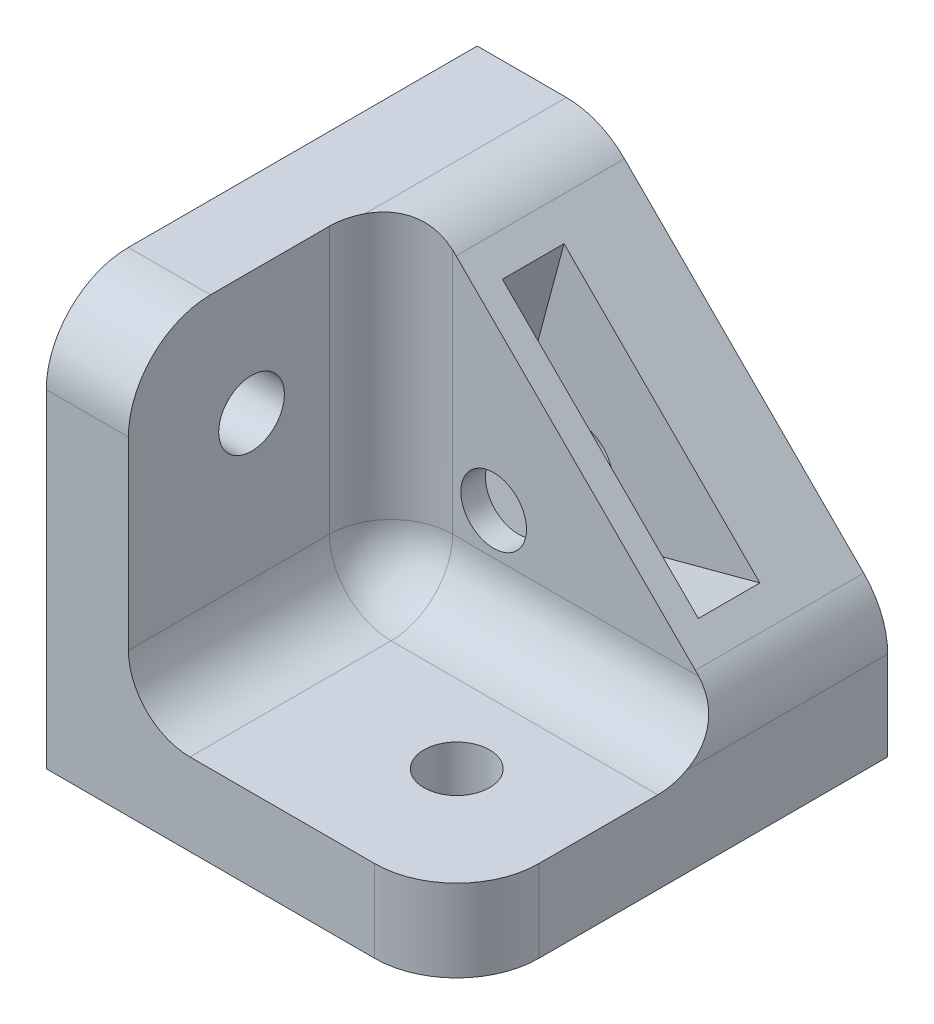
ISO-10303-21;
HEADER;
FILE_DESCRIPTION(('STEP AP214'),'2;1');
FILE_NAME('part.step','',(''),(''),'','','');
FILE_SCHEMA(('AUTOMOTIVE_DESIGN { 1 0 10303 214 1 1 1 1 }'));
ENDSEC;
DATA;
#1=APPLICATION_CONTEXT('core data for automotive mechanical design processes');
#2=APPLICATION_PROTOCOL_DEFINITION('international standard','automotive_design',2000,#1);
#3=PRODUCT_CONTEXT('',#1,'mechanical');
#4=PRODUCT('Part','Part','',(#3));
#5=PRODUCT_RELATED_PRODUCT_CATEGORY('part','',(#4));
#6=PRODUCT_DEFINITION_FORMATION('','',#4);
#7=PRODUCT_DEFINITION_CONTEXT('part definition',#1,'design');
#8=PRODUCT_DEFINITION('design','',#6,#7);
#9=PRODUCT_DEFINITION_SHAPE('','',#8);
#10=(LENGTH_UNIT() NAMED_UNIT(*) SI_UNIT(.MILLI.,.METRE.));
#11=(NAMED_UNIT(*) PLANE_ANGLE_UNIT() SI_UNIT($,.RADIAN.));
#12=(NAMED_UNIT(*) SI_UNIT($,.STERADIAN.) SOLID_ANGLE_UNIT());
#13=UNCERTAINTY_MEASURE_WITH_UNIT(LENGTH_MEASURE(1.E-05),#10,'distance_accuracy_value','');
#14=(GEOMETRIC_REPRESENTATION_CONTEXT(3) GLOBAL_UNCERTAINTY_ASSIGNED_CONTEXT((#13)) GLOBAL_UNIT_ASSIGNED_CONTEXT((#10,
#11,#12)) REPRESENTATION_CONTEXT('',''));
#15=CARTESIAN_POINT('',(0.,0.,0.));
#16=DIRECTION('',(0.,0.,1.));
#17=DIRECTION('',(1.,0.,0.));
#18=AXIS2_PLACEMENT_3D('',#15,#16,#17);
#19=CARTESIAN_POINT('',(9.,9.,0.));
#20=DIRECTION('',(0.,0.,-1.));
#21=DIRECTION('',(-1.,0.,0.));
#22=AXIS2_PLACEMENT_3D('',#19,#20,#21);
#23=CYLINDRICAL_SURFACE('',#22,1.59999999999999);
#24=CARTESIAN_POINT('',(9.,9.,0.));
#25=DIRECTION('',(0.,0.,-1.));
#26=DIRECTION('',(-1.,0.,0.));
#27=AXIS2_PLACEMENT_3D('',#24,#25,#26);
#28=CIRCLE('',#27,1.59999999999999);
#29=CARTESIAN_POINT('',(7.40000000000001,9.,0.));
#30=VERTEX_POINT('',#29);
#31=EDGE_CURVE('E220',#30,#30,#28,.T.);
#32=ORIENTED_EDGE('',*,*,#31,.T.);
#33=EDGE_LOOP('',(#32));
#34=FACE_BOUND('',#33,.T.);
#35=CARTESIAN_POINT('',(9.,9.,4.));
#36=DIRECTION('',(0.,0.,1.));
#37=DIRECTION('',(1.,0.,0.));
#38=AXIS2_PLACEMENT_3D('',#35,#36,#37);
#39=CIRCLE('',#38,1.59999999999999);
#40=CARTESIAN_POINT('',(10.6,9.,4.));
#41=VERTEX_POINT('',#40);
#42=EDGE_CURVE('E430',#41,#41,#39,.F.);
#43=ORIENTED_EDGE('',*,*,#42,.F.);
#44=EDGE_LOOP('',(#43));
#45=FACE_BOUND('',#44,.T.);
#46=ADVANCED_FACE('F48',(#34,#45),#23,.F.);
#47=CARTESIAN_POINT('',(20.,0.,8.2));
#48=DIRECTION('',(-1.,0.,0.));
#49=DIRECTION('',(0.,-1.,0.));
#50=AXIS2_PLACEMENT_3D('',#47,#48,#49);
#51=PLANE('',#50);
#52=DIRECTION('',(0.,1.,0.));
#53=VECTOR('',#52,1.);
#54=CARTESIAN_POINT('',(20.,0.,0.));
#55=LINE('',#54,#53);
#56=CARTESIAN_POINT('',(20.,0.,0.));
#57=VERTEX_POINT('',#56);
#58=CARTESIAN_POINT('',(20.,4.34314575050762,0.));
#59=VERTEX_POINT('',#58);
#60=EDGE_CURVE('E240',#57,#59,#55,.T.);
#61=ORIENTED_EDGE('',*,*,#60,.T.);
#62=DIRECTION('',(0.,0.,-1.));
#63=VECTOR('',#62,1.);
#64=CARTESIAN_POINT('',(20.,4.34314575050762,8.37157287525375));
#65=LINE('',#64,#63);
#66=CARTESIAN_POINT('',(20.,4.34314575050762,9.80675720100397));
#67=VERTEX_POINT('',#66);
#68=EDGE_CURVE('E481',#59,#67,#65,.F.);
#69=ORIENTED_EDGE('',*,*,#68,.T.);
#70=CARTESIAN_POINT('',(20.,7.,11.2));
#71=DIRECTION('',(-1.,0.,0.));
#72=DIRECTION('',(0.,-1.,0.));
#73=AXIS2_PLACEMENT_3D('',#70,#71,#72);
#74=CIRCLE('',#73,3.);
#75=CARTESIAN_POINT('',(20.,4.,11.2));
#76=VERTEX_POINT('',#75);
#77=EDGE_CURVE('E283',#67,#76,#74,.T.);
#78=ORIENTED_EDGE('',*,*,#77,.T.);
#79=DIRECTION('',(0.,0.,-1.));
#80=VECTOR('',#79,1.);
#81=CARTESIAN_POINT('',(20.,4.,21.));
#82=LINE('',#81,#80);
#83=CARTESIAN_POINT('',(20.,4.,17.));
#84=VERTEX_POINT('',#83);
#85=EDGE_CURVE('E238',#84,#76,#82,.T.);
#86=ORIENTED_EDGE('',*,*,#85,.F.);
#87=DIRECTION('',(0.,1.,0.));
#88=VECTOR('',#87,1.);
#89=CARTESIAN_POINT('',(20.,0.,17.));
#90=LINE('',#89,#88);
#91=CARTESIAN_POINT('',(20.,0.,17.));
#92=VERTEX_POINT('',#91);
#93=EDGE_CURVE('E325',#84,#92,#90,.F.);
#94=ORIENTED_EDGE('',*,*,#93,.T.);
#95=DIRECTION('',(0.,0.,-1.));
#96=VECTOR('',#95,1.);
#97=CARTESIAN_POINT('',(20.,0.,8.2));
#98=LINE('',#97,#96);
#99=EDGE_CURVE('E244',#92,#57,#98,.T.);
#100=ORIENTED_EDGE('',*,*,#99,.T.);
#101=EDGE_LOOP('',(#61,#69,#78,#86,#94,#100));
#102=FACE_BOUND('',#101,.T.);
#103=ADVANCED_FACE('F350',(#102),#51,.F.);
#104=CARTESIAN_POINT('',(13.,13.,8.2));
#105=DIRECTION('',(0.707106781186547,0.707106781186548,0.));
#106=DIRECTION('',(-0.707106781186548,0.707106781186547,0.));
#107=AXIS2_PLACEMENT_3D('',#104,#105,#106);
#108=PLANE('',#107);
#109=DIRECTION('',(0.707106781186548,-0.707106781186547,0.));
#110=VECTOR('',#109,1.);
#111=CARTESIAN_POINT('',(8.22841718477347,17.7715828152265,7.));
#112=LINE('',#111,#110);
#113=CARTESIAN_POINT('',(8.22841718477347,17.7715828152265,7.));
#114=VERTEX_POINT('',#113);
#115=CARTESIAN_POINT('',(17.7715828152265,8.22841718477347,7.));
#116=VERTEX_POINT('',#115);
#117=EDGE_CURVE('E190',#114,#116,#112,.T.);
#118=ORIENTED_EDGE('',*,*,#117,.F.);
#119=DIRECTION('',(0.,0.,-1.));
#120=VECTOR('',#119,1.);
#121=CARTESIAN_POINT('',(8.22841718477347,17.7715828152265,7.));
#122=LINE('',#121,#120);
#123=CARTESIAN_POINT('',(8.22841718477347,17.7715828152265,4.));
#124=VERTEX_POINT('',#123);
#125=EDGE_CURVE('E432',#114,#124,#122,.T.);
#126=ORIENTED_EDGE('',*,*,#125,.T.);
#127=DIRECTION('',(0.707106781186548,-0.707106781186547,0.));
#128=VECTOR('',#127,1.);
#129=CARTESIAN_POINT('',(8.22841718477347,17.7715828152265,4.));
#130=LINE('',#129,#128);
#131=CARTESIAN_POINT('',(17.7715828152265,8.22841718477348,4.));
#132=VERTEX_POINT('',#131);
#133=EDGE_CURVE('E204',#124,#132,#130,.T.);
#134=ORIENTED_EDGE('',*,*,#133,.T.);
#135=DIRECTION('',(0.,0.,-1.));
#136=VECTOR('',#135,1.);
#137=CARTESIAN_POINT('',(17.7715828152265,8.22841718477347,7.));
#138=LINE('',#137,#136);
#139=EDGE_CURVE('E183',#116,#132,#138,.T.);
#140=ORIENTED_EDGE('',*,*,#139,.F.);
#141=EDGE_LOOP('',(#118,#126,#134,#140));
#142=FACE_BOUND('',#141,.T.);
#143=DIRECTION('',(0.707106781186548,-0.707106781186547,0.));
#144=VECTOR('',#143,1.);
#145=CARTESIAN_POINT('',(13.,13.,0.));
#146=LINE('',#145,#144);
#147=CARTESIAN_POINT('',(7.17157287525381,18.8284271247462,0.));
#148=VERTEX_POINT('',#147);
#149=CARTESIAN_POINT('',(18.8284271247462,7.17157287525381,0.));
#150=VERTEX_POINT('',#149);
#151=EDGE_CURVE('E248',#148,#150,#146,.T.);
#152=ORIENTED_EDGE('',*,*,#151,.F.);
#153=DIRECTION('',(0.,0.,-1.));
#154=VECTOR('',#153,1.);
#155=CARTESIAN_POINT('',(7.17157287525381,18.8284271247462,8.2));
#156=LINE('',#155,#154);
#157=CARTESIAN_POINT('',(7.17157287525381,18.8284271247462,8.2));
#158=VERTEX_POINT('',#157);
#159=EDGE_CURVE('E311',#148,#158,#156,.F.);
#160=ORIENTED_EDGE('',*,*,#159,.T.);
#161=DIRECTION('',(0.707106781186548,-0.707106781186547,0.));
#162=VECTOR('',#161,1.);
#163=CARTESIAN_POINT('',(13.,13.,8.2));
#164=LINE('',#163,#162);
#165=CARTESIAN_POINT('',(18.8284271247462,7.17157287525381,8.2));
#166=VERTEX_POINT('',#165);
#167=EDGE_CURVE('E241',#158,#166,#164,.T.);
#168=ORIENTED_EDGE('',*,*,#167,.T.);
#169=DIRECTION('',(0.,0.,-1.));
#170=VECTOR('',#169,1.);
#171=CARTESIAN_POINT('',(18.8284271247462,7.17157287525382,0.));
#172=LINE('',#171,#170);
#173=EDGE_CURVE('E308',#166,#150,#172,.T.);
#174=ORIENTED_EDGE('',*,*,#173,.T.);
#175=EDGE_LOOP('',(#152,#160,#168,#174));
#176=FACE_BOUND('',#175,.T.);
#177=ADVANCED_FACE('F202',(#142,#176),#108,.T.);
#178=CARTESIAN_POINT('',(0.,20.,8.2));
#179=DIRECTION('',(0.,1.,0.));
#180=DIRECTION('',(0.,0.,1.));
#181=AXIS2_PLACEMENT_3D('',#178,#179,#180);
#182=PLANE('',#181);
#183=CARTESIAN_POINT('',(7.,20.,11.2));
#184=DIRECTION('',(0.,1.,0.));
#185=DIRECTION('',(0.,0.,1.));
#186=AXIS2_PLACEMENT_3D('',#183,#184,#185);
#187=CIRCLE('',#186,3.);
#188=CARTESIAN_POINT('',(4.,20.,11.2));
#189=VERTEX_POINT('',#188);
#190=CARTESIAN_POINT('',(4.34314575050762,20.,9.80675720100396));
#191=VERTEX_POINT('',#190);
#192=EDGE_CURVE('E288',#189,#191,#187,.F.);
#193=ORIENTED_EDGE('',*,*,#192,.T.);
#194=DIRECTION('',(0.,0.,-1.));
#195=VECTOR('',#194,1.);
#196=CARTESIAN_POINT('',(4.34314575050762,20.,8.2));
#197=LINE('',#196,#195);
#198=CARTESIAN_POINT('',(4.34314575050762,20.,0.));
#199=VERTEX_POINT('',#198);
#200=EDGE_CURVE('E301',#191,#199,#197,.T.);
#201=ORIENTED_EDGE('',*,*,#200,.T.);
#202=DIRECTION('',(1.,0.,0.));
#203=VECTOR('',#202,1.);
#204=CARTESIAN_POINT('',(0.,20.,0.));
#205=LINE('',#204,#203);
#206=CARTESIAN_POINT('',(0.,20.,0.));
#207=VERTEX_POINT('',#206);
#208=EDGE_CURVE('E251',#207,#199,#205,.T.);
#209=ORIENTED_EDGE('',*,*,#208,.F.);
#210=DIRECTION('',(0.,0.,-1.));
#211=VECTOR('',#210,1.);
#212=CARTESIAN_POINT('',(0.,20.,8.2));
#213=LINE('',#212,#211);
#214=CARTESIAN_POINT('',(0.,20.,17.));
#215=VERTEX_POINT('',#214);
#216=EDGE_CURVE('E262',#215,#207,#213,.T.);
#217=ORIENTED_EDGE('',*,*,#216,.F.);
#218=DIRECTION('',(1.,0.,0.));
#219=VECTOR('',#218,1.);
#220=CARTESIAN_POINT('',(0.,20.,17.));
#221=LINE('',#220,#219);
#222=CARTESIAN_POINT('',(4.,20.,17.));
#223=VERTEX_POINT('',#222);
#224=EDGE_CURVE('E291',#215,#223,#221,.T.);
#225=ORIENTED_EDGE('',*,*,#224,.T.);
#226=DIRECTION('',(0.,0.,-1.));
#227=VECTOR('',#226,1.);
#228=CARTESIAN_POINT('',(4.,20.,21.));
#229=LINE('',#228,#227);
#230=EDGE_CURVE('E236',#223,#189,#229,.T.);
#231=ORIENTED_EDGE('',*,*,#230,.T.);
#232=EDGE_LOOP('',(#193,#201,#209,#217,#225,#231));
#233=FACE_BOUND('',#232,.T.);
#234=ADVANCED_FACE('F395',(#233),#182,.T.);
#235=CARTESIAN_POINT('',(0.,0.,8.2));
#236=DIRECTION('',(-1.,0.,0.));
#237=DIRECTION('',(0.,0.,1.));
#238=AXIS2_PLACEMENT_3D('',#235,#236,#237);
#239=PLANE('',#238);
#240=CARTESIAN_POINT('',(0.,14.,15.));
#241=DIRECTION('',(-1.,0.,0.));
#242=DIRECTION('',(0.,0.,1.));
#243=AXIS2_PLACEMENT_3D('',#240,#241,#242);
#244=CIRCLE('',#243,1.59999999999999);
#245=CARTESIAN_POINT('',(0.,14.,16.6));
#246=VERTEX_POINT('',#245);
#247=EDGE_CURVE('E216',#246,#246,#244,.T.);
#248=ORIENTED_EDGE('',*,*,#247,.F.);
#249=EDGE_LOOP('',(#248));
#250=FACE_BOUND('',#249,.T.);
#251=DIRECTION('',(0.,1.,0.));
#252=VECTOR('',#251,1.);
#253=CARTESIAN_POINT('',(0.,0.,21.));
#254=LINE('',#253,#252);
#255=CARTESIAN_POINT('',(0.,0.,21.));
#256=VERTEX_POINT('',#255);
#257=CARTESIAN_POINT('',(0.,16.,21.));
#258=VERTEX_POINT('',#257);
#259=EDGE_CURVE('E234',#256,#258,#254,.T.);
#260=ORIENTED_EDGE('',*,*,#259,.T.);
#261=CARTESIAN_POINT('',(0.,16.,17.));
#262=DIRECTION('',(-1.,0.,0.));
#263=DIRECTION('',(0.,0.,1.));
#264=AXIS2_PLACEMENT_3D('',#261,#262,#263);
#265=CIRCLE('',#264,4.);
#266=EDGE_CURVE('E13',#258,#215,#265,.T.);
#267=ORIENTED_EDGE('',*,*,#266,.T.);
#268=ORIENTED_EDGE('',*,*,#216,.T.);
#269=DIRECTION('',(0.,1.,0.));
#270=VECTOR('',#269,1.);
#271=CARTESIAN_POINT('',(0.,0.,0.));
#272=LINE('',#271,#270);
#273=CARTESIAN_POINT('',(0.,0.,0.));
#274=VERTEX_POINT('',#273);
#275=EDGE_CURVE('E254',#274,#207,#272,.T.);
#276=ORIENTED_EDGE('',*,*,#275,.F.);
#277=DIRECTION('',(0.,0.,-1.));
#278=VECTOR('',#277,1.);
#279=CARTESIAN_POINT('',(0.,0.,8.2));
#280=LINE('',#279,#278);
#281=EDGE_CURVE('E260',#256,#274,#280,.T.);
#282=ORIENTED_EDGE('',*,*,#281,.F.);
#283=EDGE_LOOP('',(#260,#267,#268,#276,#282));
#284=FACE_BOUND('',#283,.T.);
#285=ADVANCED_FACE('F490',(#250,#284),#239,.T.);
#286=CARTESIAN_POINT('',(0.,0.,8.2));
#287=DIRECTION('',(0.,1.,0.));
#288=DIRECTION('',(0.,0.,1.));
#289=AXIS2_PLACEMENT_3D('',#286,#287,#288);
#290=PLANE('',#289);
#291=CARTESIAN_POINT('',(14.,0.,15.));
#292=DIRECTION('',(0.,-1.,0.));
#293=DIRECTION('',(0.,0.,-1.));
#294=AXIS2_PLACEMENT_3D('',#291,#292,#293);
#295=CIRCLE('',#294,1.59999999999999);
#296=CARTESIAN_POINT('',(14.,0.,13.4));
#297=VERTEX_POINT('',#296);
#298=EDGE_CURVE('E211',#297,#297,#295,.T.);
#299=ORIENTED_EDGE('',*,*,#298,.F.);
#300=EDGE_LOOP('',(#299));
#301=FACE_BOUND('',#300,.T.);
#302=ORIENTED_EDGE('',*,*,#99,.F.);
#303=CARTESIAN_POINT('',(16.,0.,17.));
#304=DIRECTION('',(0.,1.,0.));
#305=DIRECTION('',(0.,0.,1.));
#306=AXIS2_PLACEMENT_3D('',#303,#304,#305);
#307=CIRCLE('',#306,4.);
#308=CARTESIAN_POINT('',(16.,0.,21.));
#309=VERTEX_POINT('',#308);
#310=EDGE_CURVE('E425',#92,#309,#307,.F.);
#311=ORIENTED_EDGE('',*,*,#310,.T.);
#312=DIRECTION('',(1.,0.,0.));
#313=VECTOR('',#312,1.);
#314=CARTESIAN_POINT('',(0.,0.,21.));
#315=LINE('',#314,#313);
#316=EDGE_CURVE('E226',#256,#309,#315,.T.);
#317=ORIENTED_EDGE('',*,*,#316,.F.);
#318=ORIENTED_EDGE('',*,*,#281,.T.);
#319=DIRECTION('',(1.,0.,0.));
#320=VECTOR('',#319,1.);
#321=CARTESIAN_POINT('',(0.,0.,0.));
#322=LINE('',#321,#320);
#323=EDGE_CURVE('E245',#274,#57,#322,.T.);
#324=ORIENTED_EDGE('',*,*,#323,.T.);
#325=EDGE_LOOP('',(#302,#311,#317,#318,#324));
#326=FACE_BOUND('',#325,.T.);
#327=ADVANCED_FACE('F380',(#301,#326),#290,.F.);
#328=CARTESIAN_POINT('',(0.,0.,8.2));
#329=DIRECTION('',(0.,0.,1.));
#330=DIRECTION('',(1.,0.,0.));
#331=AXIS2_PLACEMENT_3D('',#328,#329,#330);
#332=PLANE('',#331);
#333=CARTESIAN_POINT('',(9.,9.,8.2));
#334=DIRECTION('',(0.,0.,1.));
#335=DIRECTION('',(1.,0.,0.));
#336=AXIS2_PLACEMENT_3D('',#333,#334,#335);
#337=CIRCLE('',#336,1.59999999999999);
#338=CARTESIAN_POINT('',(10.6,9.,8.2));
#339=VERTEX_POINT('',#338);
#340=EDGE_CURVE('E223',#339,#339,#337,.T.);
#341=ORIENTED_EDGE('',*,*,#340,.F.);
#342=EDGE_LOOP('',(#341));
#343=FACE_BOUND('',#342,.T.);
#344=ORIENTED_EDGE('',*,*,#167,.F.);
#345=CARTESIAN_POINT('',(4.34314575050762,16.,8.2));
#346=DIRECTION('',(0.,0.,1.));
#347=DIRECTION('',(1.,0.,0.));
#348=AXIS2_PLACEMENT_3D('',#345,#346,#347);
#349=CIRCLE('',#348,4.);
#350=CARTESIAN_POINT('',(7.,18.9901714828675,8.2));
#351=VERTEX_POINT('',#350);
#352=EDGE_CURVE('E315',#158,#351,#349,.T.);
#353=ORIENTED_EDGE('',*,*,#352,.T.);
#354=DIRECTION('',(0.,-1.,0.));
#355=VECTOR('',#354,1.);
#356=CARTESIAN_POINT('',(7.,0.,8.2));
#357=LINE('',#356,#355);
#358=CARTESIAN_POINT('',(7.,7.,8.2));
#359=VERTEX_POINT('',#358);
#360=EDGE_CURVE('E273',#351,#359,#357,.T.);
#361=ORIENTED_EDGE('',*,*,#360,.T.);
#362=DIRECTION('',(-1.,0.,0.));
#363=VECTOR('',#362,1.);
#364=CARTESIAN_POINT('',(20.,7.,8.2));
#365=LINE('',#364,#363);
#366=CARTESIAN_POINT('',(18.9901714828676,7.,8.2));
#367=VERTEX_POINT('',#366);
#368=EDGE_CURVE('E275',#359,#367,#365,.F.);
#369=ORIENTED_EDGE('',*,*,#368,.T.);
#370=CARTESIAN_POINT('',(16.,4.34314575050762,8.2));
#371=DIRECTION('',(0.,0.,1.));
#372=DIRECTION('',(1.,0.,0.));
#373=AXIS2_PLACEMENT_3D('',#370,#371,#372);
#374=CIRCLE('',#373,4.);
#375=EDGE_CURVE('E313',#367,#166,#374,.T.);
#376=ORIENTED_EDGE('',*,*,#375,.T.);
#377=EDGE_LOOP('',(#344,#353,#361,#369,#376));
#378=FACE_BOUND('',#377,.T.);
#379=ADVANCED_FACE('F376',(#343,#378),#332,.T.);
#380=CARTESIAN_POINT('',(0.,0.,0.));
#381=DIRECTION('',(0.,0.,1.));
#382=DIRECTION('',(1.,0.,0.));
#383=AXIS2_PLACEMENT_3D('',#380,#381,#382);
#384=PLANE('',#383);
#385=ORIENTED_EDGE('',*,*,#31,.F.);
#386=EDGE_LOOP('',(#385));
#387=FACE_BOUND('',#386,.T.);
#388=ORIENTED_EDGE('',*,*,#208,.T.);
#389=CARTESIAN_POINT('',(4.34314575050762,16.,0.));
#390=DIRECTION('',(0.,0.,1.));
#391=DIRECTION('',(1.,0.,0.));
#392=AXIS2_PLACEMENT_3D('',#389,#390,#391);
#393=CIRCLE('',#392,4.);
#394=EDGE_CURVE('E306',#199,#148,#393,.F.);
#395=ORIENTED_EDGE('',*,*,#394,.T.);
#396=ORIENTED_EDGE('',*,*,#151,.T.);
#397=CARTESIAN_POINT('',(16.,4.34314575050762,0.));
#398=DIRECTION('',(0.,0.,1.));
#399=DIRECTION('',(1.,0.,0.));
#400=AXIS2_PLACEMENT_3D('',#397,#398,#399);
#401=CIRCLE('',#400,4.);
#402=EDGE_CURVE('E304',#150,#59,#401,.F.);
#403=ORIENTED_EDGE('',*,*,#402,.T.);
#404=ORIENTED_EDGE('',*,*,#60,.F.);
#405=ORIENTED_EDGE('',*,*,#323,.F.);
#406=ORIENTED_EDGE('',*,*,#275,.T.);
#407=EDGE_LOOP('',(#388,#395,#396,#403,#404,#405,#406));
#408=FACE_BOUND('',#407,.T.);
#409=ADVANCED_FACE('F379',(#387,#408),#384,.F.);
#410=CARTESIAN_POINT('',(0.,4.,21.));
#411=DIRECTION('',(0.,1.,0.));
#412=DIRECTION('',(0.,0.,1.));
#413=AXIS2_PLACEMENT_3D('',#410,#411,#412);
#414=PLANE('',#413);
#415=CARTESIAN_POINT('',(14.,4.,15.));
#416=DIRECTION('',(0.,1.,0.));
#417=DIRECTION('',(0.,0.,1.));
#418=AXIS2_PLACEMENT_3D('',#415,#416,#417);
#419=CIRCLE('',#418,1.59999999999999);
#420=CARTESIAN_POINT('',(14.,4.,16.6));
#421=VERTEX_POINT('',#420);
#422=EDGE_CURVE('E214',#421,#421,#419,.T.);
#423=ORIENTED_EDGE('',*,*,#422,.F.);
#424=EDGE_LOOP('',(#423));
#425=FACE_BOUND('',#424,.T.);
#426=DIRECTION('',(1.,0.,0.));
#427=VECTOR('',#426,1.);
#428=CARTESIAN_POINT('',(0.,4.,21.));
#429=LINE('',#428,#427);
#430=CARTESIAN_POINT('',(7.,4.,21.));
#431=VERTEX_POINT('',#430);
#432=CARTESIAN_POINT('',(16.,4.,21.));
#433=VERTEX_POINT('',#432);
#434=EDGE_CURVE('E229',#431,#433,#429,.T.);
#435=ORIENTED_EDGE('',*,*,#434,.T.);
#436=CARTESIAN_POINT('',(16.,4.,17.));
#437=DIRECTION('',(0.,1.,0.));
#438=DIRECTION('',(0.,0.,1.));
#439=AXIS2_PLACEMENT_3D('',#436,#437,#438);
#440=CIRCLE('',#439,4.);
#441=EDGE_CURVE('E427',#433,#84,#440,.T.);
#442=ORIENTED_EDGE('',*,*,#441,.T.);
#443=ORIENTED_EDGE('',*,*,#85,.T.);
#444=DIRECTION('',(-1.,0.,0.));
#445=VECTOR('',#444,1.);
#446=CARTESIAN_POINT('',(4.,4.,11.2));
#447=LINE('',#446,#445);
#448=CARTESIAN_POINT('',(7.,4.,11.2));
#449=VERTEX_POINT('',#448);
#450=EDGE_CURVE('E270',#76,#449,#447,.T.);
#451=ORIENTED_EDGE('',*,*,#450,.T.);
#452=DIRECTION('',(0.,0.,-1.));
#453=VECTOR('',#452,1.);
#454=CARTESIAN_POINT('',(7.,4.,21.));
#455=LINE('',#454,#453);
#456=EDGE_CURVE('E264',#449,#431,#455,.F.);
#457=ORIENTED_EDGE('',*,*,#456,.T.);
#458=EDGE_LOOP('',(#435,#442,#443,#451,#457));
#459=FACE_BOUND('',#458,.T.);
#460=ADVANCED_FACE('F498',(#425,#459),#414,.T.);
#461=CARTESIAN_POINT('',(4.,0.,21.));
#462=DIRECTION('',(-1.,0.,0.));
#463=DIRECTION('',(0.,0.,1.));
#464=AXIS2_PLACEMENT_3D('',#461,#462,#463);
#465=PLANE('',#464);
#466=CARTESIAN_POINT('',(4.,14.,15.));
#467=DIRECTION('',(-1.,0.,0.));
#468=DIRECTION('',(0.,0.,1.));
#469=AXIS2_PLACEMENT_3D('',#466,#467,#468);
#470=CIRCLE('',#469,1.59999999999999);
#471=CARTESIAN_POINT('',(4.,14.,16.6));
#472=VERTEX_POINT('',#471);
#473=EDGE_CURVE('E219',#472,#472,#470,.T.);
#474=ORIENTED_EDGE('',*,*,#473,.T.);
#475=EDGE_LOOP('',(#474));
#476=FACE_BOUND('',#475,.T.);
#477=ORIENTED_EDGE('',*,*,#230,.F.);
#478=CARTESIAN_POINT('',(4.,16.,17.));
#479=DIRECTION('',(-1.,0.,0.));
#480=DIRECTION('',(0.,0.,1.));
#481=AXIS2_PLACEMENT_3D('',#478,#479,#480);
#482=CIRCLE('',#481,4.);
#483=CARTESIAN_POINT('',(4.,16.,21.));
#484=VERTEX_POINT('',#483);
#485=EDGE_CURVE('E57',#223,#484,#482,.F.);
#486=ORIENTED_EDGE('',*,*,#485,.T.);
#487=DIRECTION('',(0.,1.,0.));
#488=VECTOR('',#487,1.);
#489=CARTESIAN_POINT('',(4.,0.,21.));
#490=LINE('',#489,#488);
#491=CARTESIAN_POINT('',(4.,7.,21.));
#492=VERTEX_POINT('',#491);
#493=EDGE_CURVE('E232',#492,#484,#490,.T.);
#494=ORIENTED_EDGE('',*,*,#493,.F.);
#495=DIRECTION('',(0.,0.,-1.));
#496=VECTOR('',#495,1.);
#497=CARTESIAN_POINT('',(4.,7.,21.));
#498=LINE('',#497,#496);
#499=CARTESIAN_POINT('',(4.,7.,11.2));
#500=VERTEX_POINT('',#499);
#501=EDGE_CURVE('E281',#492,#500,#498,.T.);
#502=ORIENTED_EDGE('',*,*,#501,.T.);
#503=DIRECTION('',(0.,-1.,0.));
#504=VECTOR('',#503,1.);
#505=CARTESIAN_POINT('',(4.,0.,11.2));
#506=LINE('',#505,#504);
#507=EDGE_CURVE('E278',#500,#189,#506,.F.);
#508=ORIENTED_EDGE('',*,*,#507,.T.);
#509=EDGE_LOOP('',(#477,#486,#494,#502,#508));
#510=FACE_BOUND('',#509,.T.);
#511=ADVANCED_FACE('F370',(#476,#510),#465,.F.);
#512=CARTESIAN_POINT('',(0.,0.,21.));
#513=DIRECTION('',(0.,0.,1.));
#514=DIRECTION('',(1.,0.,0.));
#515=AXIS2_PLACEMENT_3D('',#512,#513,#514);
#516=PLANE('',#515);
#517=ORIENTED_EDGE('',*,*,#316,.T.);
#518=DIRECTION('',(0.,1.,0.));
#519=VECTOR('',#518,1.);
#520=CARTESIAN_POINT('',(16.,4.,21.));
#521=LINE('',#520,#519);
#522=EDGE_CURVE('E688',#309,#433,#521,.T.);
#523=ORIENTED_EDGE('',*,*,#522,.T.);
#524=ORIENTED_EDGE('',*,*,#434,.F.);
#525=CARTESIAN_POINT('',(7.,7.,21.));
#526=DIRECTION('',(0.,0.,1.));
#527=DIRECTION('',(1.,0.,0.));
#528=AXIS2_PLACEMENT_3D('',#525,#526,#527);
#529=CIRCLE('',#528,3.);
#530=EDGE_CURVE('E286',#431,#492,#529,.F.);
#531=ORIENTED_EDGE('',*,*,#530,.T.);
#532=ORIENTED_EDGE('',*,*,#493,.T.);
#533=DIRECTION('',(1.,0.,0.));
#534=VECTOR('',#533,1.);
#535=CARTESIAN_POINT('',(0.,16.,21.));
#536=LINE('',#535,#534);
#537=EDGE_CURVE('E73',#484,#258,#536,.F.);
#538=ORIENTED_EDGE('',*,*,#537,.T.);
#539=ORIENTED_EDGE('',*,*,#259,.F.);
#540=EDGE_LOOP('',(#517,#523,#524,#531,#532,#538,#539));
#541=FACE_BOUND('',#540,.T.);
#542=ADVANCED_FACE('F363',(#541),#516,.T.);
#543=CARTESIAN_POINT('',(9.,9.,7.));
#544=DIRECTION('',(0.,0.,1.));
#545=DIRECTION('',(1.,0.,0.));
#546=AXIS2_PLACEMENT_3D('',#543,#544,#545);
#547=CIRCLE('',#546,1.59999999999999);
#548=CARTESIAN_POINT('',(10.6,9.,7.));
#549=VERTEX_POINT('',#548);
#550=EDGE_CURVE('E52',#549,#549,#547,.F.);
#551=ORIENTED_EDGE('',*,*,#550,.T.);
#552=EDGE_LOOP('',(#551));
#553=FACE_BOUND('',#552,.T.);
#554=ORIENTED_EDGE('',*,*,#340,.T.);
#555=EDGE_LOOP('',(#554));
#556=FACE_BOUND('',#555,.T.);
#557=ADVANCED_FACE('F353',(#553,#556),#23,.F.);
#558=CARTESIAN_POINT('',(0.,14.,15.));
#559=DIRECTION('',(-1.,0.,0.));
#560=DIRECTION('',(0.,0.,1.));
#561=AXIS2_PLACEMENT_3D('',#558,#559,#560);
#562=CYLINDRICAL_SURFACE('',#561,1.59999999999999);
#563=ORIENTED_EDGE('',*,*,#247,.T.);
#564=EDGE_LOOP('',(#563));
#565=FACE_BOUND('',#564,.T.);
#566=ORIENTED_EDGE('',*,*,#473,.F.);
#567=EDGE_LOOP('',(#566));
#568=FACE_BOUND('',#567,.T.);
#569=ADVANCED_FACE('F345',(#565,#568),#562,.F.);
#570=CARTESIAN_POINT('',(14.,0.,15.));
#571=DIRECTION('',(0.,-1.,0.));
#572=DIRECTION('',(0.,0.,-1.));
#573=AXIS2_PLACEMENT_3D('',#570,#571,#572);
#574=CYLINDRICAL_SURFACE('',#573,1.59999999999999);
#575=ORIENTED_EDGE('',*,*,#422,.T.);
#576=EDGE_LOOP('',(#575));
#577=FACE_BOUND('',#576,.T.);
#578=ORIENTED_EDGE('',*,*,#298,.T.);
#579=EDGE_LOOP('',(#578));
#580=FACE_BOUND('',#579,.T.);
#581=ADVANCED_FACE('F340',(#577,#580),#574,.F.);
#582=CARTESIAN_POINT('',(7.,7.,21.));
#583=DIRECTION('',(0.,0.,-1.));
#584=DIRECTION('',(-1.,0.,0.));
#585=AXIS2_PLACEMENT_3D('',#582,#583,#584);
#586=CYLINDRICAL_SURFACE('',#585,3.);
#587=ORIENTED_EDGE('',*,*,#530,.F.);
#588=ORIENTED_EDGE('',*,*,#456,.F.);
#589=CARTESIAN_POINT('',(7.,7.,11.2));
#590=DIRECTION('',(0.,0.,1.));
#591=DIRECTION('',(1.,0.,0.));
#592=AXIS2_PLACEMENT_3D('',#589,#590,#591);
#593=CIRCLE('',#592,3.);
#594=EDGE_CURVE('E215',#500,#449,#593,.T.);
#595=ORIENTED_EDGE('',*,*,#594,.F.);
#596=ORIENTED_EDGE('',*,*,#501,.F.);
#597=EDGE_LOOP('',(#587,#588,#595,#596));
#598=FACE_BOUND('',#597,.T.);
#599=ADVANCED_FACE('F336',(#598),#586,.F.);
#600=CARTESIAN_POINT('',(7.,0.,11.2));
#601=DIRECTION('',(0.,-1.,0.));
#602=DIRECTION('',(0.,0.,-1.));
#603=AXIS2_PLACEMENT_3D('',#600,#601,#602);
#604=CYLINDRICAL_SURFACE('',#603,3.);
#605=ORIENTED_EDGE('',*,*,#360,.F.);
#606=CARTESIAN_POINT('',(7.,18.9901714828675,8.2));
#607=CARTESIAN_POINT('',(6.94193324538843,19.0417822124814,8.1999949168267));
#608=CARTESIAN_POINT('',(6.8823280799505,19.0916992893009,8.20168608511162));
#609=CARTESIAN_POINT('',(6.76041938623259,19.1879140926809,8.20895913845615));
#610=CARTESIAN_POINT('',(6.69811375017107,19.2342089099468,8.21454411594756));
#611=CARTESIAN_POINT('',(6.57109258991714,19.3229926012827,8.23012712211471));
#612=CARTESIAN_POINT('',(6.50637060865955,19.3654700639315,8.24013788537597));
#613=CARTESIAN_POINT('',(6.37527099763818,19.4462138318352,8.26501058923978));
#614=CARTESIAN_POINT('',(6.30889382863381,19.4844812933363,8.27987119339917));
#615=CARTESIAN_POINT('',(6.17475567829458,19.5568305408274,8.31490001589676));
#616=CARTESIAN_POINT('',(6.10698907042575,19.5908879819129,8.33509716198485));
#617=CARTESIAN_POINT('',(5.97119641030128,19.6544591616513,8.38101077760638));
#618=CARTESIAN_POINT('',(5.90317037354584,19.6839731675356,8.40672692231551));
#619=CARTESIAN_POINT('',(5.76784313091683,19.7383872799478,8.46373223181656));
#620=CARTESIAN_POINT('',(5.70054048218207,19.7632994032598,8.49500645108352));
#621=CARTESIAN_POINT('',(5.56732056667246,19.8087213751306,8.56313837026891));
#622=CARTESIAN_POINT('',(5.50140318204756,19.8292315995557,8.59999559301093));
#623=CARTESIAN_POINT('',(5.31703437153165,19.8816135376273,8.71259891085768));
#624=CARTESIAN_POINT('',(5.20109993187058,19.908503639816,8.79495201602613));
#625=CARTESIAN_POINT('',(4.98078233234528,19.9504535798456,8.97665979283801));
#626=CARTESIAN_POINT('',(4.87642334238074,19.9654890500956,9.07604897515313));
#627=CARTESIAN_POINT('',(4.6939733325975,19.9855162367049,9.27686629517975));
#628=CARTESIAN_POINT('',(4.61423879543945,19.9914729389041,9.37671198661477));
#629=CARTESIAN_POINT('',(4.50477585744998,19.9968995164344,9.53329504232));
#630=CARTESIAN_POINT('',(4.47002527265375,19.9981244537405,9.58653510080915));
#631=CARTESIAN_POINT('',(4.40397082695786,19.9996731797925,9.6951185403529));
#632=CARTESIAN_POINT('',(4.37266664216903,19.999997053289,9.75046172309931));
#633=CARTESIAN_POINT('',(4.34314575050762,20.,9.80675720100396));
#634=B_SPLINE_CURVE_WITH_KNOTS('',3,(#606,#607,#608,#609,#610,#611,#612,#613,#614,#615,#616,
#617,#618,#619,#620,#621,#622,#623,#624,#625,#626,#627,#628,#629,#630,#631,#632,#633),
.UNSPECIFIED.,.F.,.F.,(4,2,2,2,2,2,2,2,2,2,2,2,2,4),(0.,0.233049307220485,0.466283911468105,
0.700194028587575,0.934039742770372,1.169180037518,1.40430649672177,1.63881001782728,
1.87329350733521,2.30528263690606,2.73815743620396,3.12067154591015,3.3113232079451,
3.50195693740874),.UNSPECIFIED.);
#635=EDGE_CURVE('E317',#351,#191,#634,.T.);
#636=ORIENTED_EDGE('',*,*,#635,.T.);
#637=ORIENTED_EDGE('',*,*,#192,.F.);
#638=ORIENTED_EDGE('',*,*,#507,.F.);
#639=CARTESIAN_POINT('',(7.,7.,11.2));
#640=DIRECTION('',(0.,1.,0.));
#641=DIRECTION('',(0.,0.,1.));
#642=AXIS2_PLACEMENT_3D('',#639,#640,#641);
#643=CIRCLE('',#642,3.);
#644=EDGE_CURVE('E294',#359,#500,#643,.T.);
#645=ORIENTED_EDGE('',*,*,#644,.F.);
#646=EDGE_LOOP('',(#605,#636,#637,#638,#645));
#647=FACE_BOUND('',#646,.T.);
#648=ADVANCED_FACE('F331',(#647),#604,.F.);
#649=CARTESIAN_POINT('',(7.,7.,11.2));
#650=DIRECTION('',(0.,0.,1.));
#651=DIRECTION('',(1.,0.,0.));
#652=AXIS2_PLACEMENT_3D('',#649,#650,#651);
#653=SPHERICAL_SURFACE('',#652,3.);
#654=ORIENTED_EDGE('',*,*,#644,.T.);
#655=ORIENTED_EDGE('',*,*,#594,.T.);
#656=CARTESIAN_POINT('',(7.,7.,11.2));
#657=DIRECTION('',(1.,0.,0.));
#658=DIRECTION('',(0.,0.,-1.));
#659=AXIS2_PLACEMENT_3D('',#656,#657,#658);
#660=CIRCLE('',#659,3.);
#661=EDGE_CURVE('E292',#359,#449,#660,.F.);
#662=ORIENTED_EDGE('',*,*,#661,.F.);
#663=EDGE_LOOP('',(#654,#655,#662));
#664=FACE_BOUND('',#663,.T.);
#665=ADVANCED_FACE('F335',(#664),#653,.F.);
#666=CARTESIAN_POINT('',(0.,7.,11.2));
#667=DIRECTION('',(1.,0.,0.));
#668=DIRECTION('',(0.,0.,-1.));
#669=AXIS2_PLACEMENT_3D('',#666,#667,#668);
#670=CYLINDRICAL_SURFACE('',#669,3.);
#671=ORIENTED_EDGE('',*,*,#77,.F.);
#672=CARTESIAN_POINT('',(20.,4.34314575050762,9.80675720100397));
#673=CARTESIAN_POINT('',(19.999994516871,4.37938233415865,9.73763654733412));
#674=CARTESIAN_POINT('',(19.9995075419756,4.41833496497999,9.66993140738563));
#675=CARTESIAN_POINT('',(19.9970858664403,4.50139579207969,9.53775526059803));
#676=CARTESIAN_POINT('',(19.9951506369785,4.54550586660358,9.47328544429655));
#677=CARTESIAN_POINT('',(19.9893363714825,4.63874869545481,9.34780466852999));
#678=CARTESIAN_POINT('',(19.9854502378048,4.68789926440104,9.28680725090656));
#679=CARTESIAN_POINT('',(19.9752183262964,4.79070279087007,9.16896143920759));
#680=CARTESIAN_POINT('',(19.9688728668811,4.84435516482807,9.11211250914827));
#681=CARTESIAN_POINT('',(19.9531895567949,4.95590535915363,9.00277507646831));
#682=CARTESIAN_POINT('',(19.9438413562149,5.01381732130213,8.95030245794811));
#683=CARTESIAN_POINT('',(19.9216781282054,5.13316006046357,8.85032620419197));
#684=CARTESIAN_POINT('',(19.9088633349242,5.19459059959613,8.80282223365295));
#685=CARTESIAN_POINT('',(19.8793853855297,5.3201379141356,8.71323645651316));
#686=CARTESIAN_POINT('',(19.8627334448375,5.38424642361787,8.67113939417385));
#687=CARTESIAN_POINT('',(19.8252253643262,5.51457515617551,8.59245209342362));
#688=CARTESIAN_POINT('',(19.8043695934617,5.58079519350085,8.55586137223346));
#689=CARTESIAN_POINT('',(19.7597172064537,5.71022502962667,8.49049950966196));
#690=CARTESIAN_POINT('',(19.7361977131227,5.77335283502164,8.46137586216528));
#691=CARTESIAN_POINT('',(19.685179019527,5.90010578434214,8.40805407633517));
#692=CARTESIAN_POINT('',(19.6576784843911,5.9637310882861,8.38385759669096));
#693=CARTESIAN_POINT('',(19.5986443113074,6.09091008143863,8.3402654637133));
#694=CARTESIAN_POINT('',(19.5671033880754,6.15446342676497,8.32087867294824));
#695=CARTESIAN_POINT('',(19.5001104710456,6.28075969230725,8.28675796502491));
#696=CARTESIAN_POINT('',(19.4646571178942,6.34350232233259,8.27202567195926));
#697=CARTESIAN_POINT('',(19.3643294155987,6.51020727063422,8.23833201817521));
#698=CARTESIAN_POINT('',(19.2959523127789,6.61292956707997,8.22339901803067));
#699=CARTESIAN_POINT('',(19.1863051986352,6.76208609777778,8.20903139682069));
#700=CARTESIAN_POINT('',(19.1486509049453,6.81089933330348,8.20557986103814));
#701=CARTESIAN_POINT('',(19.0710807136916,6.90678746088172,8.20106554741344));
#702=CARTESIAN_POINT('',(19.0311654860783,6.95386286112363,8.20000206571019));
#703=CARTESIAN_POINT('',(18.9901714828676,7.,8.2));
#704=B_SPLINE_CURVE_WITH_KNOTS('',3,(#672,#673,#674,#675,#676,#677,#678,#679,#680,#681,#682,
#683,#684,#685,#686,#687,#688,#689,#690,#691,#692,#693,#694,#695,#696,#697,#698,#699,#700,#701,
#702,#703),.UNSPECIFIED.,.F.,.F.,(4,2,2,2,2,2,2,2,2,2,2,2,2,2,2,4),(0.,0.234080629192734,
0.468246773310987,0.703271086211311,0.938264980056828,1.17407770746172,1.40987451105406,
1.64499066611029,1.88008619487163,2.09998997476751,2.31996766146326,2.54034772847018,
2.76080460792364,3.13244721313666,3.31759526126536,3.50268873122272),.UNSPECIFIED.);
#705=EDGE_CURVE('E413',#67,#367,#704,.T.);
#706=ORIENTED_EDGE('',*,*,#705,.T.);
#707=ORIENTED_EDGE('',*,*,#368,.F.);
#708=ORIENTED_EDGE('',*,*,#661,.T.);
#709=ORIENTED_EDGE('',*,*,#450,.F.);
#710=EDGE_LOOP('',(#671,#706,#707,#708,#709));
#711=FACE_BOUND('',#710,.T.);
#712=ADVANCED_FACE('F411',(#711),#670,.F.);
#713=CARTESIAN_POINT('',(4.34314575050762,16.,8.2));
#714=DIRECTION('',(0.,0.,-1.));
#715=DIRECTION('',(-1.,0.,0.));
#716=AXIS2_PLACEMENT_3D('',#713,#714,#715);
#717=CYLINDRICAL_SURFACE('',#716,4.);
#718=ORIENTED_EDGE('',*,*,#352,.F.);
#719=ORIENTED_EDGE('',*,*,#159,.F.);
#720=ORIENTED_EDGE('',*,*,#394,.F.);
#721=ORIENTED_EDGE('',*,*,#200,.F.);
#722=ORIENTED_EDGE('',*,*,#635,.F.);
#723=EDGE_LOOP('',(#718,#719,#720,#721,#722));
#724=FACE_BOUND('',#723,.T.);
#725=ADVANCED_FACE('F327',(#724),#717,.T.);
#726=CARTESIAN_POINT('',(16.,4.34314575050762,8.2));
#727=DIRECTION('',(0.,0.,1.));
#728=DIRECTION('',(1.,0.,0.));
#729=AXIS2_PLACEMENT_3D('',#726,#727,#728);
#730=CYLINDRICAL_SURFACE('',#729,4.);
#731=ORIENTED_EDGE('',*,*,#705,.F.);
#732=ORIENTED_EDGE('',*,*,#68,.F.);
#733=ORIENTED_EDGE('',*,*,#402,.F.);
#734=ORIENTED_EDGE('',*,*,#173,.F.);
#735=ORIENTED_EDGE('',*,*,#375,.F.);
#736=EDGE_LOOP('',(#731,#732,#733,#734,#735));
#737=FACE_BOUND('',#736,.T.);
#738=ADVANCED_FACE('F415',(#737),#730,.T.);
#739=CARTESIAN_POINT('',(16.,0.,17.));
#740=DIRECTION('',(0.,-1.,0.));
#741=DIRECTION('',(1.,0.,0.));
#742=AXIS2_PLACEMENT_3D('',#739,#740,#741);
#743=CYLINDRICAL_SURFACE('',#742,4.);
#744=ORIENTED_EDGE('',*,*,#310,.F.);
#745=ORIENTED_EDGE('',*,*,#93,.F.);
#746=ORIENTED_EDGE('',*,*,#441,.F.);
#747=ORIENTED_EDGE('',*,*,#522,.F.);
#748=EDGE_LOOP('',(#744,#745,#746,#747));
#749=FACE_BOUND('',#748,.T.);
#750=ADVANCED_FACE('F465',(#749),#743,.T.);
#751=CARTESIAN_POINT('',(0.,16.,17.));
#752=DIRECTION('',(1.,0.,0.));
#753=DIRECTION('',(0.,0.,-1.));
#754=AXIS2_PLACEMENT_3D('',#751,#752,#753);
#755=CYLINDRICAL_SURFACE('',#754,4.);
#756=ORIENTED_EDGE('',*,*,#266,.F.);
#757=ORIENTED_EDGE('',*,*,#537,.F.);
#758=ORIENTED_EDGE('',*,*,#485,.F.);
#759=ORIENTED_EDGE('',*,*,#224,.F.);
#760=EDGE_LOOP('',(#756,#757,#758,#759));
#761=FACE_BOUND('',#760,.T.);
#762=ADVANCED_FACE('F50',(#761),#755,.T.);
#763=CARTESIAN_POINT('',(0.,0.,7.));
#764=DIRECTION('',(0.,0.,1.));
#765=DIRECTION('',(1.,0.,0.));
#766=AXIS2_PLACEMENT_3D('',#763,#764,#765);
#767=PLANE('',#766);
#768=ORIENTED_EDGE('',*,*,#117,.T.);
#769=DIRECTION('',(-0.965925826289068,-0.258819045102523,0.));
#770=VECTOR('',#769,1.);
#771=CARTESIAN_POINT('',(8.11611652351681,5.6412427893639,7.));
#772=LINE('',#771,#770);
#773=CARTESIAN_POINT('',(8.11611652351681,5.6412427893639,7.));
#774=VERTEX_POINT('',#773);
#775=EDGE_CURVE('E179',#116,#774,#772,.T.);
#776=ORIENTED_EDGE('',*,*,#775,.T.);
#777=DIRECTION('',(-0.707106781186547,0.707106781186547,0.));
#778=VECTOR('',#777,1.);
#779=CARTESIAN_POINT('',(5.6412427893639,8.11611652351681,7.));
#780=LINE('',#779,#778);
#781=CARTESIAN_POINT('',(5.6412427893639,8.11611652351681,7.));
#782=VERTEX_POINT('',#781);
#783=EDGE_CURVE('E189',#774,#782,#780,.T.);
#784=ORIENTED_EDGE('',*,*,#783,.T.);
#785=DIRECTION('',(0.258819045102523,0.965925826289068,0.));
#786=VECTOR('',#785,1.);
#787=CARTESIAN_POINT('',(8.22841718477347,17.7715828152265,7.));
#788=LINE('',#787,#786);
#789=EDGE_CURVE('E197',#782,#114,#788,.T.);
#790=ORIENTED_EDGE('',*,*,#789,.T.);
#791=EDGE_LOOP('',(#768,#776,#784,#790));
#792=FACE_BOUND('',#791,.T.);
#793=ORIENTED_EDGE('',*,*,#550,.F.);
#794=EDGE_LOOP('',(#793));
#795=FACE_BOUND('',#794,.T.);
#796=ADVANCED_FACE('F194',(#792,#795),#767,.F.);
#797=CARTESIAN_POINT('',(0.,0.,4.));
#798=DIRECTION('',(0.,0.,1.));
#799=DIRECTION('',(1.,0.,0.));
#800=AXIS2_PLACEMENT_3D('',#797,#798,#799);
#801=PLANE('',#800);
#802=ORIENTED_EDGE('',*,*,#133,.F.);
#803=DIRECTION('',(0.258819045102523,0.965925826289068,0.));
#804=VECTOR('',#803,1.);
#805=CARTESIAN_POINT('',(8.22841718477347,17.7715828152265,4.));
#806=LINE('',#805,#804);
#807=CARTESIAN_POINT('',(5.6412427893639,8.11611652351681,4.));
#808=VERTEX_POINT('',#807);
#809=EDGE_CURVE('E200',#808,#124,#806,.T.);
#810=ORIENTED_EDGE('',*,*,#809,.F.);
#811=DIRECTION('',(-0.707106781186547,0.707106781186547,0.));
#812=VECTOR('',#811,1.);
#813=CARTESIAN_POINT('',(5.6412427893639,8.11611652351681,4.));
#814=LINE('',#813,#812);
#815=CARTESIAN_POINT('',(8.11611652351681,5.6412427893639,4.));
#816=VERTEX_POINT('',#815);
#817=EDGE_CURVE('E439',#816,#808,#814,.T.);
#818=ORIENTED_EDGE('',*,*,#817,.F.);
#819=DIRECTION('',(-0.965925826289068,-0.258819045102523,0.));
#820=VECTOR('',#819,1.);
#821=CARTESIAN_POINT('',(8.11611652351681,5.6412427893639,4.));
#822=LINE('',#821,#820);
#823=EDGE_CURVE('E65',#132,#816,#822,.T.);
#824=ORIENTED_EDGE('',*,*,#823,.F.);
#825=EDGE_LOOP('',(#802,#810,#818,#824));
#826=FACE_BOUND('',#825,.T.);
#827=ORIENTED_EDGE('',*,*,#42,.T.);
#828=EDGE_LOOP('',(#827));
#829=FACE_BOUND('',#828,.T.);
#830=ADVANCED_FACE('F448',(#826,#829),#801,.T.);
#831=CARTESIAN_POINT('',(8.22841718477347,17.7715828152265,7.));
#832=DIRECTION('',(-0.965925826289068,0.258819045102523,0.));
#833=DIRECTION('',(-0.258819045102523,-0.965925826289068,0.));
#834=AXIS2_PLACEMENT_3D('',#831,#832,#833);
#835=PLANE('',#834);
#836=ORIENTED_EDGE('',*,*,#809,.T.);
#837=ORIENTED_EDGE('',*,*,#125,.F.);
#838=ORIENTED_EDGE('',*,*,#789,.F.);
#839=DIRECTION('',(0.,0.,-1.));
#840=VECTOR('',#839,1.);
#841=CARTESIAN_POINT('',(5.6412427893639,8.11611652351681,7.));
#842=LINE('',#841,#840);
#843=EDGE_CURVE('E206',#782,#808,#842,.T.);
#844=ORIENTED_EDGE('',*,*,#843,.T.);
#845=EDGE_LOOP('',(#836,#837,#838,#844));
#846=FACE_BOUND('',#845,.T.);
#847=ADVANCED_FACE('F446',(#846),#835,.F.);
#848=CARTESIAN_POINT('',(5.6412427893639,8.11611652351681,7.));
#849=DIRECTION('',(-0.707106781186548,-0.707106781186548,0.));
#850=DIRECTION('',(0.707106781186548,-0.707106781186548,0.));
#851=AXIS2_PLACEMENT_3D('',#848,#849,#850);
#852=PLANE('',#851);
#853=ORIENTED_EDGE('',*,*,#817,.T.);
#854=ORIENTED_EDGE('',*,*,#843,.F.);
#855=ORIENTED_EDGE('',*,*,#783,.F.);
#856=DIRECTION('',(0.,0.,-1.));
#857=VECTOR('',#856,1.);
#858=CARTESIAN_POINT('',(8.11611652351681,5.6412427893639,7.));
#859=LINE('',#858,#857);
#860=EDGE_CURVE('E185',#774,#816,#859,.T.);
#861=ORIENTED_EDGE('',*,*,#860,.T.);
#862=EDGE_LOOP('',(#853,#854,#855,#861));
#863=FACE_BOUND('',#862,.T.);
#864=ADVANCED_FACE('F449',(#863),#852,.F.);
#865=CARTESIAN_POINT('',(8.11611652351681,5.6412427893639,7.));
#866=DIRECTION('',(0.258819045102523,-0.965925826289067,0.));
#867=DIRECTION('',(0.965925826289068,0.258819045102523,0.));
#868=AXIS2_PLACEMENT_3D('',#865,#866,#867);
#869=PLANE('',#868);
#870=ORIENTED_EDGE('',*,*,#823,.T.);
#871=ORIENTED_EDGE('',*,*,#860,.F.);
#872=ORIENTED_EDGE('',*,*,#775,.F.);
#873=ORIENTED_EDGE('',*,*,#139,.T.);
#874=EDGE_LOOP('',(#870,#871,#872,#873));
#875=FACE_BOUND('',#874,.T.);
#876=ADVANCED_FACE('F181',(#875),#869,.F.);
#877=CLOSED_SHELL('',(#46,#103,#177,#234,#285,#327,#379,#409,#460,#511,#542,#557,#569,#581,#599,
#648,#665,#712,#725,#738,#750,#762,#796,#830,#847,#864,#876));
#878=MANIFOLD_SOLID_BREP('B2',#877);
#879=ADVANCED_BREP_SHAPE_REPRESENTATION('',(#18,#878),#14);
#880=SHAPE_DEFINITION_REPRESENTATION(#9,#879);
ENDSEC;
END-ISO-10303-21;
